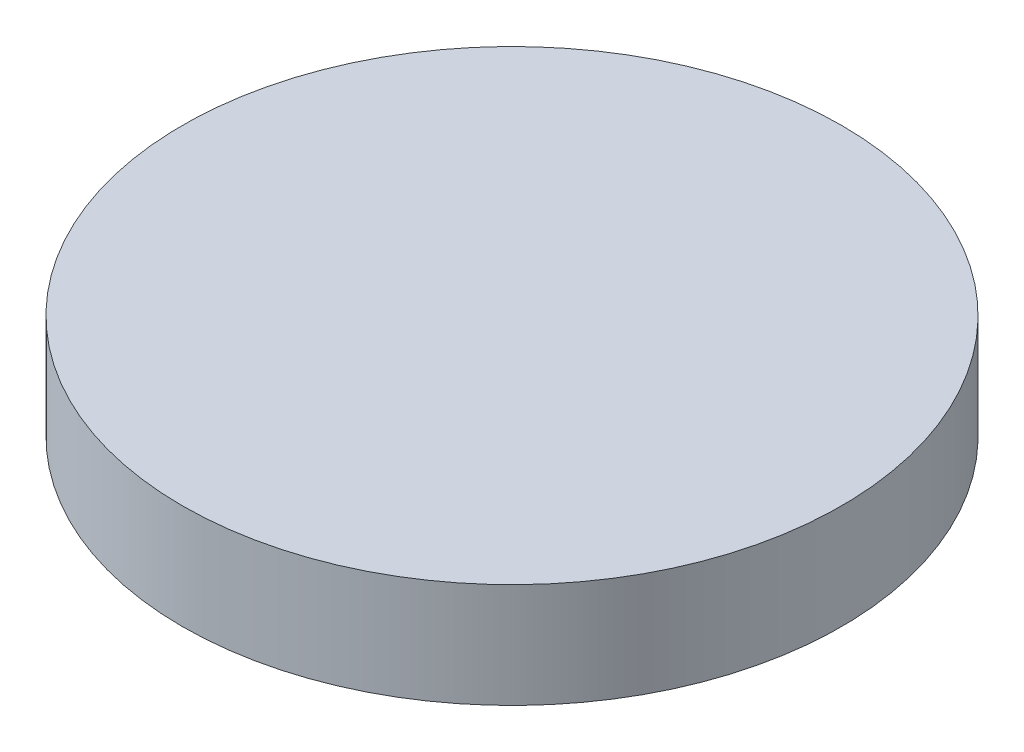
ISO-10303-21;
HEADER;
FILE_DESCRIPTION(('STEP AP214'),'2;1');
FILE_NAME('part.step','',(''),(''),'','','');
FILE_SCHEMA(('AUTOMOTIVE_DESIGN { 1 0 10303 214 1 1 1 1 }'));
ENDSEC;
DATA;
#1=APPLICATION_CONTEXT('core data for automotive mechanical design processes');
#2=APPLICATION_PROTOCOL_DEFINITION('international standard','automotive_design',2000,#1);
#3=PRODUCT_CONTEXT('',#1,'mechanical');
#4=PRODUCT('Part','Part','',(#3));
#5=PRODUCT_RELATED_PRODUCT_CATEGORY('part','',(#4));
#6=PRODUCT_DEFINITION_FORMATION('','',#4);
#7=PRODUCT_DEFINITION_CONTEXT('part definition',#1,'design');
#8=PRODUCT_DEFINITION('design','',#6,#7);
#9=PRODUCT_DEFINITION_SHAPE('','',#8);
#10=(LENGTH_UNIT() NAMED_UNIT(*) SI_UNIT(.MILLI.,.METRE.));
#11=(NAMED_UNIT(*) PLANE_ANGLE_UNIT() SI_UNIT($,.RADIAN.));
#12=(NAMED_UNIT(*) SI_UNIT($,.STERADIAN.) SOLID_ANGLE_UNIT());
#13=UNCERTAINTY_MEASURE_WITH_UNIT(LENGTH_MEASURE(1.E-05),#10,'distance_accuracy_value','');
#14=(GEOMETRIC_REPRESENTATION_CONTEXT(3) GLOBAL_UNCERTAINTY_ASSIGNED_CONTEXT((#13)) GLOBAL_UNIT_ASSIGNED_CONTEXT((#10,
#11,#12)) REPRESENTATION_CONTEXT('',''));
#15=CARTESIAN_POINT('',(0.,0.,0.));
#16=DIRECTION('',(0.,0.,1.));
#17=DIRECTION('',(1.,0.,0.));
#18=AXIS2_PLACEMENT_3D('',#15,#16,#17);
#19=CARTESIAN_POINT('',(0.,6.35,0.));
#20=DIRECTION('',(0.,-1.,0.));
#21=DIRECTION('',(0.,0.,-1.));
#22=AXIS2_PLACEMENT_3D('',#19,#20,#21);
#23=CYLINDRICAL_SURFACE('',#22,20.);
#24=CARTESIAN_POINT('',(0.,6.35,0.));
#25=DIRECTION('',(0.,1.,0.));
#26=DIRECTION('',(0.,0.,1.));
#27=AXIS2_PLACEMENT_3D('',#24,#25,#26);
#28=CIRCLE('',#27,20.);
#29=CARTESIAN_POINT('',(0.,6.35,20.));
#30=VERTEX_POINT('',#29);
#31=EDGE_CURVE('E10',#30,#30,#28,.T.);
#32=ORIENTED_EDGE('',*,*,#31,.F.);
#33=EDGE_LOOP('',(#32));
#34=FACE_BOUND('',#33,.T.);
#35=CARTESIAN_POINT('',(0.,0.,0.));
#36=DIRECTION('',(0.,1.,0.));
#37=DIRECTION('',(0.,0.,1.));
#38=AXIS2_PLACEMENT_3D('',#35,#36,#37);
#39=CIRCLE('',#38,20.);
#40=CARTESIAN_POINT('',(0.,0.,20.));
#41=VERTEX_POINT('',#40);
#42=EDGE_CURVE('E37',#41,#41,#39,.T.);
#43=ORIENTED_EDGE('',*,*,#42,.T.);
#44=EDGE_LOOP('',(#43));
#45=FACE_BOUND('',#44,.T.);
#46=ADVANCED_FACE('F34',(#34,#45),#23,.T.);
#47=CARTESIAN_POINT('',(0.,6.35,0.));
#48=DIRECTION('',(0.,1.,0.));
#49=DIRECTION('',(0.,0.,1.));
#50=AXIS2_PLACEMENT_3D('',#47,#48,#49);
#51=PLANE('',#50);
#52=ORIENTED_EDGE('',*,*,#31,.T.);
#53=EDGE_LOOP('',(#52));
#54=FACE_BOUND('',#53,.T.);
#55=ADVANCED_FACE('F49',(#54),#51,.T.);
#56=CARTESIAN_POINT('',(0.,0.,0.));
#57=DIRECTION('',(0.,1.,0.));
#58=DIRECTION('',(0.,0.,1.));
#59=AXIS2_PLACEMENT_3D('',#56,#57,#58);
#60=PLANE('',#59);
#61=ORIENTED_EDGE('',*,*,#42,.F.);
#62=EDGE_LOOP('',(#61));
#63=FACE_BOUND('',#62,.T.);
#64=ADVANCED_FACE('F47',(#63),#60,.F.);
#65=CLOSED_SHELL('',(#46,#55,#64));
#66=MANIFOLD_SOLID_BREP('B2',#65);
#67=ADVANCED_BREP_SHAPE_REPRESENTATION('',(#18,#66),#14);
#68=SHAPE_DEFINITION_REPRESENTATION(#9,#67);
ENDSEC;
END-ISO-10303-21;
